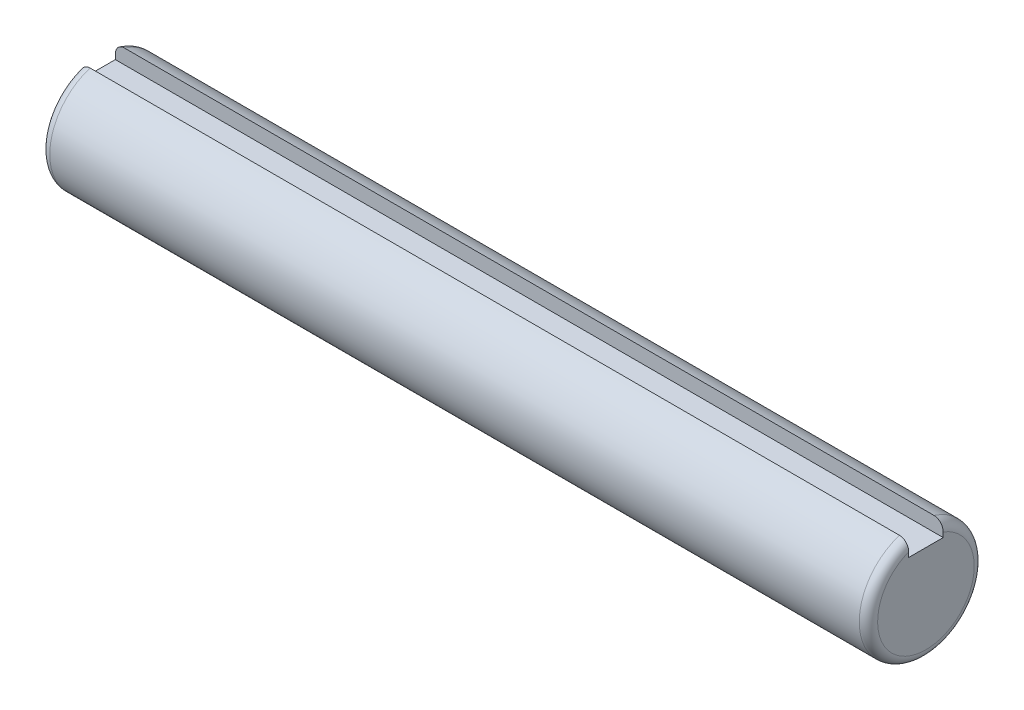
ISO-10303-21;
HEADER;
FILE_DESCRIPTION(('STEP AP214'),'2;1');
FILE_NAME('part.step','',(''),(''),'','','');
FILE_SCHEMA(('AUTOMOTIVE_DESIGN { 1 0 10303 214 1 1 1 1 }'));
ENDSEC;
DATA;
#1=APPLICATION_CONTEXT('core data for automotive mechanical design processes');
#2=APPLICATION_PROTOCOL_DEFINITION('international standard','automotive_design',2000,#1);
#3=PRODUCT_CONTEXT('',#1,'mechanical');
#4=PRODUCT('Part','Part','',(#3));
#5=PRODUCT_RELATED_PRODUCT_CATEGORY('part','',(#4));
#6=PRODUCT_DEFINITION_FORMATION('','',#4);
#7=PRODUCT_DEFINITION_CONTEXT('part definition',#1,'design');
#8=PRODUCT_DEFINITION('design','',#6,#7);
#9=PRODUCT_DEFINITION_SHAPE('','',#8);
#10=(LENGTH_UNIT() NAMED_UNIT(*) SI_UNIT(.MILLI.,.METRE.));
#11=(NAMED_UNIT(*) PLANE_ANGLE_UNIT() SI_UNIT($,.RADIAN.));
#12=(NAMED_UNIT(*) SI_UNIT($,.STERADIAN.) SOLID_ANGLE_UNIT());
#13=UNCERTAINTY_MEASURE_WITH_UNIT(LENGTH_MEASURE(1.E-05),#10,'distance_accuracy_value','');
#14=(GEOMETRIC_REPRESENTATION_CONTEXT(3) GLOBAL_UNCERTAINTY_ASSIGNED_CONTEXT((#13)) GLOBAL_UNIT_ASSIGNED_CONTEXT((#10,
#11,#12)) REPRESENTATION_CONTEXT('',''));
#15=CARTESIAN_POINT('',(0.,0.,0.));
#16=DIRECTION('',(0.,0.,1.));
#17=DIRECTION('',(1.,0.,0.));
#18=AXIS2_PLACEMENT_3D('',#15,#16,#17);
#19=CARTESIAN_POINT('',(114.3,0.,0.));
#20=DIRECTION('',(-1.,0.,0.));
#21=DIRECTION('',(0.,0.,1.));
#22=AXIS2_PLACEMENT_3D('',#19,#20,#21);
#23=CYLINDRICAL_SURFACE('',#22,7.9375);
#24=DIRECTION('',(-1.,0.,0.));
#25=VECTOR('',#24,1.);
#26=CARTESIAN_POINT('',(114.3,7.57189241124701,-2.38125));
#27=LINE('',#26,#25);
#28=CARTESIAN_POINT('',(1.26999999999999,7.57189241124701,-2.38125));
#29=VERTEX_POINT('',#28);
#30=CARTESIAN_POINT('',(113.03,7.57189241124701,-2.38125));
#31=VERTEX_POINT('',#30);
#32=EDGE_CURVE('E113',#29,#31,#27,.F.);
#33=ORIENTED_EDGE('',*,*,#32,.T.);
#34=CARTESIAN_POINT('',(113.03,0.,0.));
#35=DIRECTION('',(1.,0.,0.));
#36=DIRECTION('',(0.,0.,-1.));
#37=AXIS2_PLACEMENT_3D('',#34,#35,#36);
#38=CIRCLE('',#37,7.9375);
#39=CARTESIAN_POINT('',(113.03,7.57189241124701,2.38125));
#40=VERTEX_POINT('',#39);
#41=EDGE_CURVE('E158',#31,#40,#38,.F.);
#42=ORIENTED_EDGE('',*,*,#41,.T.);
#43=DIRECTION('',(-1.,0.,0.));
#44=VECTOR('',#43,1.);
#45=CARTESIAN_POINT('',(114.3,7.57189241124701,2.38125));
#46=LINE('',#45,#44);
#47=CARTESIAN_POINT('',(1.26999999999999,7.57189241124701,2.38125));
#48=VERTEX_POINT('',#47);
#49=EDGE_CURVE('E94',#40,#48,#46,.T.);
#50=ORIENTED_EDGE('',*,*,#49,.T.);
#51=CARTESIAN_POINT('',(1.26999999999999,0.,0.));
#52=DIRECTION('',(1.,0.,0.));
#53=DIRECTION('',(0.,0.,-1.));
#54=AXIS2_PLACEMENT_3D('',#51,#52,#53);
#55=CIRCLE('',#54,7.9375);
#56=EDGE_CURVE('E160',#48,#29,#55,.T.);
#57=ORIENTED_EDGE('',*,*,#56,.T.);
#58=EDGE_LOOP('',(#33,#42,#50,#57));
#59=FACE_BOUND('',#58,.T.);
#60=ADVANCED_FACE('F34',(#59),#23,.T.);
#61=CARTESIAN_POINT('',(114.3,0.,0.));
#62=DIRECTION('',(1.,0.,0.));
#63=DIRECTION('',(0.,0.,-1.));
#64=AXIS2_PLACEMENT_3D('',#61,#62,#63);
#65=PLANE('',#64);
#66=DIRECTION('',(0.,1.,0.));
#67=VECTOR('',#66,1.);
#68=CARTESIAN_POINT('',(114.3,7.9375,2.38125));
#69=LINE('',#68,#67);
#70=CARTESIAN_POINT('',(114.3,5.55625,2.38125));
#71=VERTEX_POINT('',#70);
#72=CARTESIAN_POINT('',(114.3,6.22777686558374,2.38125));
#73=VERTEX_POINT('',#72);
#74=EDGE_CURVE('E90',#71,#73,#69,.T.);
#75=ORIENTED_EDGE('',*,*,#74,.T.);
#76=CARTESIAN_POINT('',(114.3,0.,0.));
#77=DIRECTION('',(1.,0.,0.));
#78=DIRECTION('',(0.,0.,-1.));
#79=AXIS2_PLACEMENT_3D('',#76,#77,#78);
#80=CIRCLE('',#79,6.6675);
#81=CARTESIAN_POINT('',(114.3,6.22777686558374,-2.38125));
#82=VERTEX_POINT('',#81);
#83=EDGE_CURVE('E118',#73,#82,#80,.T.);
#84=ORIENTED_EDGE('',*,*,#83,.T.);
#85=DIRECTION('',(0.,-1.,0.));
#86=VECTOR('',#85,1.);
#87=CARTESIAN_POINT('',(114.3,7.9375,-2.38125));
#88=LINE('',#87,#86);
#89=CARTESIAN_POINT('',(114.3,5.55625,-2.38125));
#90=VERTEX_POINT('',#89);
#91=EDGE_CURVE('E104',#82,#90,#88,.T.);
#92=ORIENTED_EDGE('',*,*,#91,.T.);
#93=DIRECTION('',(0.,0.,1.));
#94=VECTOR('',#93,1.);
#95=CARTESIAN_POINT('',(114.3,5.55625,-2.38125));
#96=LINE('',#95,#94);
#97=EDGE_CURVE('E106',#90,#71,#96,.T.);
#98=ORIENTED_EDGE('',*,*,#97,.T.);
#99=EDGE_LOOP('',(#75,#84,#92,#98));
#100=FACE_BOUND('',#99,.T.);
#101=ADVANCED_FACE('F145',(#100),#65,.T.);
#102=CARTESIAN_POINT('',(0.,0.,0.));
#103=DIRECTION('',(1.,0.,0.));
#104=DIRECTION('',(0.,0.,-1.));
#105=AXIS2_PLACEMENT_3D('',#102,#103,#104);
#106=PLANE('',#105);
#107=DIRECTION('',(0.,1.,0.));
#108=VECTOR('',#107,1.);
#109=CARTESIAN_POINT('',(0.,0.,-2.38125));
#110=LINE('',#109,#108);
#111=CARTESIAN_POINT('',(0.,5.55625,-2.38125));
#112=VERTEX_POINT('',#111);
#113=CARTESIAN_POINT('',(0.,6.22777686558374,-2.38125));
#114=VERTEX_POINT('',#113);
#115=EDGE_CURVE('E116',#112,#114,#110,.T.);
#116=ORIENTED_EDGE('',*,*,#115,.T.);
#117=CARTESIAN_POINT('',(0.,0.,0.));
#118=DIRECTION('',(1.,0.,0.));
#119=DIRECTION('',(0.,0.,-1.));
#120=AXIS2_PLACEMENT_3D('',#117,#118,#119);
#121=CIRCLE('',#120,6.6675);
#122=CARTESIAN_POINT('',(0.,6.22777686558374,2.38125));
#123=VERTEX_POINT('',#122);
#124=EDGE_CURVE('E11',#114,#123,#121,.F.);
#125=ORIENTED_EDGE('',*,*,#124,.T.);
#126=DIRECTION('',(0.,1.,0.));
#127=VECTOR('',#126,1.);
#128=CARTESIAN_POINT('',(0.,7.9375,2.38125));
#129=LINE('',#128,#127);
#130=CARTESIAN_POINT('',(0.,5.55625,2.38125));
#131=VERTEX_POINT('',#130);
#132=EDGE_CURVE('E88',#131,#123,#129,.T.);
#133=ORIENTED_EDGE('',*,*,#132,.F.);
#134=DIRECTION('',(0.,0.,1.));
#135=VECTOR('',#134,1.);
#136=CARTESIAN_POINT('',(0.,5.55625,-2.38125));
#137=LINE('',#136,#135);
#138=EDGE_CURVE('E98',#112,#131,#137,.T.);
#139=ORIENTED_EDGE('',*,*,#138,.F.);
#140=EDGE_LOOP('',(#116,#125,#133,#139));
#141=FACE_BOUND('',#140,.T.);
#142=ADVANCED_FACE('F103',(#141),#106,.F.);
#143=CARTESIAN_POINT('',(114.3,7.9375,-2.38125));
#144=DIRECTION('',(0.,0.,-1.));
#145=DIRECTION('',(0.,1.,0.));
#146=AXIS2_PLACEMENT_3D('',#143,#144,#145);
#147=PLANE('',#146);
#148=ORIENTED_EDGE('',*,*,#91,.F.);
#149=CARTESIAN_POINT('',(114.3,6.22777686558374,-2.38125));
#150=CARTESIAN_POINT('',(114.299998528073,6.26746920768222,-2.38125));
#151=CARTESIAN_POINT('',(114.298375506917,6.30714471719812,-2.38125));
#152=CARTESIAN_POINT('',(114.291868593464,6.38623440027711,-2.38125));
#153=CARTESIAN_POINT('',(114.286984091404,6.42564852357975,-2.38125));
#154=CARTESIAN_POINT('',(114.267403478485,6.54318961193378,-2.38125));
#155=CARTESIAN_POINT('',(114.247780210864,6.62055912419595,-2.38125));
#156=CARTESIAN_POINT('',(114.195593666547,6.77092803907803,-2.38125));
#157=CARTESIAN_POINT('',(114.163008988659,6.84391998315476,-2.38125));
#158=CARTESIAN_POINT('',(114.085537025993,6.9830062031715,-2.38125));
#159=CARTESIAN_POINT('',(114.040661985263,7.04910725402659,-2.38125));
#160=CARTESIAN_POINT('',(113.941831114961,7.16950367034176,-2.38125));
#161=CARTESIAN_POINT('',(113.888340051646,7.22418031329653,-2.38125));
#162=CARTESIAN_POINT('',(113.772446305722,7.32316184557244,-2.38125));
#163=CARTESIAN_POINT('',(113.71004274358,7.36746571011188,-2.38125));
#164=CARTESIAN_POINT('',(113.581807907929,7.44188836367711,-2.38125));
#165=CARTESIAN_POINT('',(113.516347040745,7.47264703480536,-2.38125));
#166=CARTESIAN_POINT('',(113.381084211625,7.52219404643524,-2.38125));
#167=CARTESIAN_POINT('',(113.311288225768,7.54099848108937,-2.38125));
#168=CARTESIAN_POINT('',(113.205698219697,7.55960994279615,-2.38125));
#169=CARTESIAN_POINT('',(113.17068986685,7.56421473857423,-2.38125));
#170=CARTESIAN_POINT('',(113.100460345722,7.57035365413695,-2.38125));
#171=CARTESIAN_POINT('',(113.065239597496,7.57189258013769,-2.38125));
#172=CARTESIAN_POINT('',(113.03,7.57189241124701,-2.38125));
#173=B_SPLINE_CURVE_WITH_KNOTS('',3,(#149,#150,#151,#152,#153,#154,#155,#156,#157,#158,#159,
#160,#161,#162,#163,#164,#165,#166,#167,#168,#169,#170,#171,#172),.UNSPECIFIED.,.F.,.F.,(4,2,2,
2,2,2,2,2,2,2,2,4),(0.,0.119008994262538,0.238040244591039,0.476269189014304,0.714893128118571,
0.953280201845112,1.1815769417372,1.40989622676439,1.62581139201883,1.84143524864311,
1.94724924271294,2.05289722634979),.UNSPECIFIED.);
#174=EDGE_CURVE('E128',#82,#31,#173,.T.);
#175=ORIENTED_EDGE('',*,*,#174,.T.);
#176=ORIENTED_EDGE('',*,*,#32,.F.);
#177=CARTESIAN_POINT('',(1.26999999999999,7.57189241124701,-2.38125));
#178=CARTESIAN_POINT('',(1.23551836399688,7.57189289429141,-2.38125));
#179=CARTESIAN_POINT('',(1.20105361942005,7.57041930573939,-2.38125));
#180=CARTESIAN_POINT('',(1.1323788142634,7.56454546509445,-2.38125));
#181=CARTESIAN_POINT('',(1.09816872185665,7.56014558516341,-2.38125));
#182=CARTESIAN_POINT('',(0.996427493826767,7.54262070700895,-2.38125));
#183=CARTESIAN_POINT('',(0.929591232531725,7.52517019137308,-2.38125));
#184=CARTESIAN_POINT('',(0.799822110541258,7.47933064751606,-2.38125));
#185=CARTESIAN_POINT('',(0.736889619357123,7.45094058564105,-2.38125));
#186=CARTESIAN_POINT('',(0.616561156146563,7.38416980483457,-2.38125));
#187=CARTESIAN_POINT('',(0.559165988873736,7.34578763671329,-2.38125));
#188=CARTESIAN_POINT('',(0.450410383645044,7.259511411966,-2.38125));
#189=CARTESIAN_POINT('',(0.39917202535662,7.21146377619617,-2.38125));
#190=CARTESIAN_POINT('',(0.305078578158769,7.1077695190399,-2.38125));
#191=CARTESIAN_POINT('',(0.262224959793136,7.05212156758543,-2.38125));
#192=CARTESIAN_POINT('',(0.184082887223281,6.93223977060406,-2.38125));
#193=CARTESIAN_POINT('',(0.149208405715618,6.86773648701536,-2.38125));
#194=CARTESIAN_POINT('',(0.0901478489827821,6.73399363940395,-2.38125));
#195=CARTESIAN_POINT('',(0.0659654049501871,6.66475247552374,-2.38125));
#196=CARTESIAN_POINT('',(0.0315175577076031,6.53433601463791,-2.38125));
#197=CARTESIAN_POINT('',(0.0196785603699602,6.47356869549316,-2.38125));
#198=CARTESIAN_POINT('',(0.00391965095726519,6.35112482772287,-2.38125));
#199=CARTESIAN_POINT('',(-1.44889728941281E-05,6.28945011429513,-2.38125));
#200=CARTESIAN_POINT('',(0.,6.22777686558374,-2.38125));
#201=B_SPLINE_CURVE_WITH_KNOTS('',3,(#177,#178,#179,#180,#181,#182,#183,#184,#185,#186,#187,
#188,#189,#190,#191,#192,#193,#194,#195,#196,#197,#198,#199,#200),.UNSPECIFIED.,.F.,.F.,(4,2,2,
2,2,2,2,2,2,2,2,4),(0.,0.103380079436691,0.206747013644793,0.412905920175525,0.619084310990282,
0.825292621247293,1.03508121144468,1.24490656215254,1.46392979591955,1.68302735656662,
1.8682521594197,2.05314327872479),.UNSPECIFIED.);
#202=EDGE_CURVE('E121',#29,#114,#201,.T.);
#203=ORIENTED_EDGE('',*,*,#202,.T.);
#204=ORIENTED_EDGE('',*,*,#115,.F.);
#205=DIRECTION('',(-1.,0.,0.));
#206=VECTOR('',#205,1.);
#207=CARTESIAN_POINT('',(114.3,5.55625,-2.38125));
#208=LINE('',#207,#206);
#209=EDGE_CURVE('E95',#90,#112,#208,.T.);
#210=ORIENTED_EDGE('',*,*,#209,.F.);
#211=EDGE_LOOP('',(#148,#175,#176,#203,#204,#210));
#212=FACE_BOUND('',#211,.T.);
#213=ADVANCED_FACE('F136',(#212),#147,.F.);
#214=CARTESIAN_POINT('',(114.3,7.9375,2.38125));
#215=DIRECTION('',(0.,0.,1.));
#216=DIRECTION('',(0.,-1.,0.));
#217=AXIS2_PLACEMENT_3D('',#214,#215,#216);
#218=PLANE('',#217);
#219=ORIENTED_EDGE('',*,*,#49,.F.);
#220=CARTESIAN_POINT('',(113.03,7.57189241124701,2.38125));
#221=CARTESIAN_POINT('',(113.064481636003,7.57189289429142,2.38125));
#222=CARTESIAN_POINT('',(113.09894638058,7.57041930573939,2.38125));
#223=CARTESIAN_POINT('',(113.167621185737,7.56454546509445,2.38125));
#224=CARTESIAN_POINT('',(113.201831278143,7.56014558516341,2.38125));
#225=CARTESIAN_POINT('',(113.303572506173,7.54262070700895,2.38125));
#226=CARTESIAN_POINT('',(113.370408767468,7.52517019137308,2.38125));
#227=CARTESIAN_POINT('',(113.500177889459,7.47933064751606,2.38125));
#228=CARTESIAN_POINT('',(113.563110380643,7.45094058564105,2.38125));
#229=CARTESIAN_POINT('',(113.683438843853,7.38416980483457,2.38125));
#230=CARTESIAN_POINT('',(113.740834011126,7.34578763671329,2.38125));
#231=CARTESIAN_POINT('',(113.849589616355,7.259511411966,2.38125));
#232=CARTESIAN_POINT('',(113.900827974643,7.21146377619617,2.38125));
#233=CARTESIAN_POINT('',(113.994921421841,7.1077695190399,2.38125));
#234=CARTESIAN_POINT('',(114.037775040207,7.05212156758543,2.38125));
#235=CARTESIAN_POINT('',(114.115917112777,6.93223977060406,2.38125));
#236=CARTESIAN_POINT('',(114.150791594284,6.86773648701536,2.38125));
#237=CARTESIAN_POINT('',(114.209852151017,6.73399363940395,2.38125));
#238=CARTESIAN_POINT('',(114.23403459505,6.66475247552374,2.38125));
#239=CARTESIAN_POINT('',(114.268482442292,6.53433601463792,2.38125));
#240=CARTESIAN_POINT('',(114.28032143963,6.47356869549316,2.38125));
#241=CARTESIAN_POINT('',(114.296080349043,6.35112482772287,2.38125));
#242=CARTESIAN_POINT('',(114.300014488973,6.28945011429513,2.38125));
#243=CARTESIAN_POINT('',(114.3,6.22777686558374,2.38125));
#244=B_SPLINE_CURVE_WITH_KNOTS('',3,(#220,#221,#222,#223,#224,#225,#226,#227,#228,#229,#230,
#231,#232,#233,#234,#235,#236,#237,#238,#239,#240,#241,#242,#243),.UNSPECIFIED.,.F.,.F.,(4,2,2,
2,2,2,2,2,2,2,2,4),(0.,0.10338007943669,0.206747013644786,0.412905920175521,0.619084310990287,
0.825292621247291,1.03508121144468,1.24490656215254,1.46392979591955,1.68302735656662,
1.8682521594197,2.05314327872479),.UNSPECIFIED.);
#245=EDGE_CURVE('E41',#40,#73,#244,.T.);
#246=ORIENTED_EDGE('',*,*,#245,.T.);
#247=ORIENTED_EDGE('',*,*,#74,.F.);
#248=DIRECTION('',(-1.,0.,0.));
#249=VECTOR('',#248,1.);
#250=CARTESIAN_POINT('',(114.3,5.55625,2.38125));
#251=LINE('',#250,#249);
#252=EDGE_CURVE('E85',#71,#131,#251,.T.);
#253=ORIENTED_EDGE('',*,*,#252,.T.);
#254=ORIENTED_EDGE('',*,*,#132,.T.);
#255=CARTESIAN_POINT('',(0.,6.22777686558374,2.38125));
#256=CARTESIAN_POINT('',(1.47192659061853E-06,6.26746920768222,2.38125));
#257=CARTESIAN_POINT('',(0.00162449308314774,6.30714471719812,2.38125));
#258=CARTESIAN_POINT('',(0.00813140653589272,6.38623440027711,2.38125));
#259=CARTESIAN_POINT('',(0.0130159085961441,6.42564852357975,2.38125));
#260=CARTESIAN_POINT('',(0.0325965215149344,6.54318961193378,2.38125));
#261=CARTESIAN_POINT('',(0.0522197891358188,6.62055912419595,2.38125));
#262=CARTESIAN_POINT('',(0.104406333453264,6.77092803907803,2.38125));
#263=CARTESIAN_POINT('',(0.136991011340631,6.84391998315475,2.38125));
#264=CARTESIAN_POINT('',(0.214462974006576,6.9830062031715,2.38125));
#265=CARTESIAN_POINT('',(0.259338014737296,7.04910725402658,2.38125));
#266=CARTESIAN_POINT('',(0.358168885038831,7.16950367034176,2.38125));
#267=CARTESIAN_POINT('',(0.411659948354076,7.22418031329653,2.38125));
#268=CARTESIAN_POINT('',(0.527553694278201,7.32316184557244,2.38125));
#269=CARTESIAN_POINT('',(0.589957256420304,7.36746571011187,2.38125));
#270=CARTESIAN_POINT('',(0.718192092071095,7.44188836367711,2.38125));
#271=CARTESIAN_POINT('',(0.783652959254536,7.47264703480536,2.38125));
#272=CARTESIAN_POINT('',(0.91891578837505,7.52219404643524,2.38125));
#273=CARTESIAN_POINT('',(0.988711774232018,7.54099848108937,2.38125));
#274=CARTESIAN_POINT('',(1.09430178030347,7.55960994279615,2.38125));
#275=CARTESIAN_POINT('',(1.12931013315022,7.56421473857423,2.38125));
#276=CARTESIAN_POINT('',(1.19953965427754,7.57035365413695,2.38125));
#277=CARTESIAN_POINT('',(1.23476040250425,7.57189258013769,2.38125));
#278=CARTESIAN_POINT('',(1.26999999999999,7.571892411247,2.38125));
#279=B_SPLINE_CURVE_WITH_KNOTS('',3,(#255,#256,#257,#258,#259,#260,#261,#262,#263,#264,#265,
#266,#267,#268,#269,#270,#271,#272,#273,#274,#275,#276,#277,#278),.UNSPECIFIED.,.F.,.F.,(4,2,2,
2,2,2,2,2,2,2,2,4),(0.,0.119008994262537,0.238040244591036,0.476269189014302,0.714893128118568,
0.953280201845105,1.18157694173719,1.40989622676439,1.62581139201882,1.84143524864311,
1.94724924271292,2.0528972263498),.UNSPECIFIED.);
#280=EDGE_CURVE('E53',#123,#48,#279,.T.);
#281=ORIENTED_EDGE('',*,*,#280,.T.);
#282=EDGE_LOOP('',(#219,#246,#247,#253,#254,#281));
#283=FACE_BOUND('',#282,.T.);
#284=ADVANCED_FACE('F87',(#283),#218,.F.);
#285=CARTESIAN_POINT('',(114.3,5.55625,-2.38125));
#286=DIRECTION('',(0.,-1.,0.));
#287=DIRECTION('',(0.,0.,-1.));
#288=AXIS2_PLACEMENT_3D('',#285,#286,#287);
#289=PLANE('',#288);
#290=ORIENTED_EDGE('',*,*,#138,.T.);
#291=ORIENTED_EDGE('',*,*,#252,.F.);
#292=ORIENTED_EDGE('',*,*,#97,.F.);
#293=ORIENTED_EDGE('',*,*,#209,.T.);
#294=EDGE_LOOP('',(#290,#291,#292,#293));
#295=FACE_BOUND('',#294,.T.);
#296=ADVANCED_FACE('F99',(#295),#289,.F.);
#297=CARTESIAN_POINT('',(113.03,0.,0.));
#298=DIRECTION('',(1.,0.,0.));
#299=DIRECTION('',(0.,0.,-1.));
#300=AXIS2_PLACEMENT_3D('',#297,#298,#299);
#301=TOROIDAL_SURFACE('',#300,6.6675,1.27);
#302=ORIENTED_EDGE('',*,*,#245,.F.);
#303=ORIENTED_EDGE('',*,*,#41,.F.);
#304=ORIENTED_EDGE('',*,*,#174,.F.);
#305=ORIENTED_EDGE('',*,*,#83,.F.);
#306=EDGE_LOOP('',(#302,#303,#304,#305));
#307=FACE_BOUND('',#306,.T.);
#308=ADVANCED_FACE('F156',(#307),#301,.T.);
#309=CARTESIAN_POINT('',(1.26999999999999,0.,0.));
#310=DIRECTION('',(1.,0.,0.));
#311=DIRECTION('',(0.,0.,-1.));
#312=AXIS2_PLACEMENT_3D('',#309,#310,#311);
#313=TOROIDAL_SURFACE('',#312,6.6675,1.27);
#314=ORIENTED_EDGE('',*,*,#280,.F.);
#315=ORIENTED_EDGE('',*,*,#124,.F.);
#316=ORIENTED_EDGE('',*,*,#202,.F.);
#317=ORIENTED_EDGE('',*,*,#56,.F.);
#318=EDGE_LOOP('',(#314,#315,#316,#317));
#319=FACE_BOUND('',#318,.T.);
#320=ADVANCED_FACE('F134',(#319),#313,.T.);
#321=CLOSED_SHELL('',(#60,#101,#142,#213,#284,#296,#308,#320));
#322=MANIFOLD_SOLID_BREP('B2',#321);
#323=ADVANCED_BREP_SHAPE_REPRESENTATION('',(#18,#322),#14);
#324=SHAPE_DEFINITION_REPRESENTATION(#9,#323);
ENDSEC;
END-ISO-10303-21;
